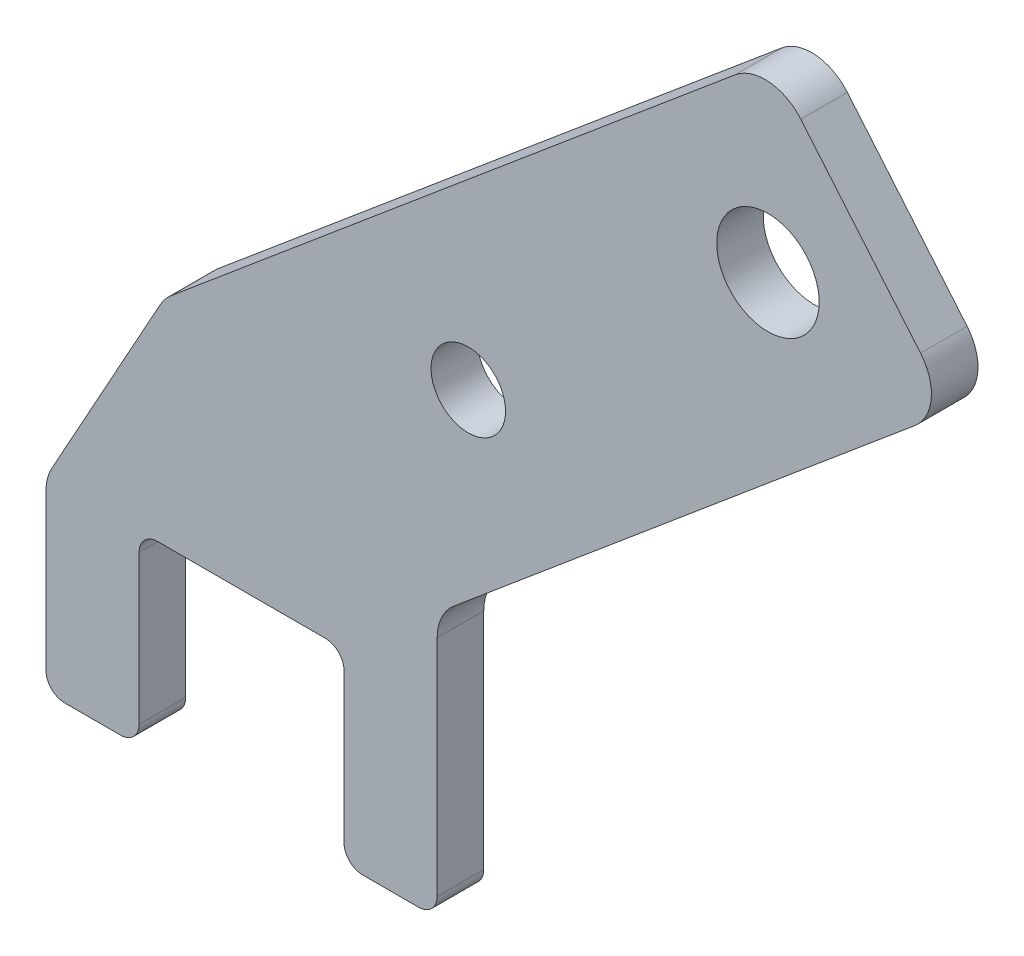
ISO-10303-21;
HEADER;
FILE_DESCRIPTION(('STEP AP214'),'2;1');
FILE_NAME('part.step','',(''),(''),'','','');
FILE_SCHEMA(('AUTOMOTIVE_DESIGN { 1 0 10303 214 1 1 1 1 }'));
ENDSEC;
DATA;
#1=APPLICATION_CONTEXT('core data for automotive mechanical design processes');
#2=APPLICATION_PROTOCOL_DEFINITION('international standard','automotive_design',2000,#1);
#3=PRODUCT_CONTEXT('',#1,'mechanical');
#4=PRODUCT('Part','Part','',(#3));
#5=PRODUCT_RELATED_PRODUCT_CATEGORY('part','',(#4));
#6=PRODUCT_DEFINITION_FORMATION('','',#4);
#7=PRODUCT_DEFINITION_CONTEXT('part definition',#1,'design');
#8=PRODUCT_DEFINITION('design','',#6,#7);
#9=PRODUCT_DEFINITION_SHAPE('','',#8);
#10=(LENGTH_UNIT() NAMED_UNIT(*) SI_UNIT(.MILLI.,.METRE.));
#11=(NAMED_UNIT(*) PLANE_ANGLE_UNIT() SI_UNIT($,.RADIAN.));
#12=(NAMED_UNIT(*) SI_UNIT($,.STERADIAN.) SOLID_ANGLE_UNIT());
#13=UNCERTAINTY_MEASURE_WITH_UNIT(LENGTH_MEASURE(1.E-05),#10,'distance_accuracy_value','');
#14=(GEOMETRIC_REPRESENTATION_CONTEXT(3) GLOBAL_UNCERTAINTY_ASSIGNED_CONTEXT((#13)) GLOBAL_UNIT_ASSIGNED_CONTEXT((#10,
#11,#12)) REPRESENTATION_CONTEXT('',''));
#15=CARTESIAN_POINT('',(0.,0.,0.));
#16=DIRECTION('',(0.,0.,1.));
#17=DIRECTION('',(1.,0.,0.));
#18=AXIS2_PLACEMENT_3D('',#15,#16,#17);
#19=CARTESIAN_POINT('',(0.,0.,5.));
#20=DIRECTION('',(0.,0.,-1.));
#21=DIRECTION('',(-1.,0.,0.));
#22=AXIS2_PLACEMENT_3D('',#19,#20,#21);
#23=PLANE('',#22);
#24=DIRECTION('',(1.,0.,0.));
#25=VECTOR('',#24,1.);
#26=CARTESIAN_POINT('',(24.3977992888339,-20.,5.));
#27=LINE('',#26,#25);
#28=CARTESIAN_POINT('',(26.3977992888339,-20.,5.));
#29=VERTEX_POINT('',#28);
#30=CARTESIAN_POINT('',(32.3977992888339,-20.,5.));
#31=VERTEX_POINT('',#30);
#32=EDGE_CURVE('E341',#29,#31,#27,.T.);
#33=ORIENTED_EDGE('',*,*,#32,.T.);
#34=CARTESIAN_POINT('',(32.3977992888339,-18.,5.));
#35=DIRECTION('',(0.,0.,-1.));
#36=DIRECTION('',(-1.,0.,0.));
#37=AXIS2_PLACEMENT_3D('',#34,#35,#36);
#38=CIRCLE('',#37,2.);
#39=CARTESIAN_POINT('',(34.3977992888339,-18.,5.));
#40=VERTEX_POINT('',#39);
#41=EDGE_CURVE('E294',#31,#40,#38,.F.);
#42=ORIENTED_EDGE('',*,*,#41,.T.);
#43=DIRECTION('',(0.,1.,0.));
#44=VECTOR('',#43,1.);
#45=CARTESIAN_POINT('',(34.3977992888339,-20.,5.));
#46=LINE('',#45,#44);
#47=CARTESIAN_POINT('',(34.3977992888339,6.05945802099784,5.));
#48=VERTEX_POINT('',#47);
#49=EDGE_CURVE('E348',#40,#48,#46,.T.);
#50=ORIENTED_EDGE('',*,*,#49,.T.);
#51=CARTESIAN_POINT('',(39.3977992888339,6.05945802099785,5.));
#52=DIRECTION('',(0.,0.,-1.));
#53=DIRECTION('',(-1.,0.,0.));
#54=AXIS2_PLACEMENT_3D('',#51,#52,#53);
#55=CIRCLE('',#54,5.);
#56=CARTESIAN_POINT('',(36.1838612404012,9.88968023659273,5.));
#57=VERTEX_POINT('',#56);
#58=EDGE_CURVE('E194',#48,#57,#55,.T.);
#59=ORIENTED_EDGE('',*,*,#58,.T.);
#60=DIRECTION('',(0.766044443118977,0.642787609686541,0.));
#61=VECTOR('',#60,1.);
#62=CARTESIAN_POINT('',(34.3977992888339,8.39099631177283,5.));
#63=LINE('',#62,#61);
#64=CARTESIAN_POINT('',(85.6813547383521,51.4230087749233,5.));
#65=VERTEX_POINT('',#64);
#66=EDGE_CURVE('E204',#57,#65,#63,.T.);
#67=ORIENTED_EDGE('',*,*,#66,.T.);
#68=CARTESIAN_POINT('',(82.4674166899194,55.2532309905182,5.));
#69=DIRECTION('',(0.,0.,-1.));
#70=DIRECTION('',(-1.,0.,0.));
#71=AXIS2_PLACEMENT_3D('',#68,#69,#70);
#72=CIRCLE('',#71,5.);
#73=CARTESIAN_POINT('',(86.2976389055143,58.4671690389509,5.));
#74=VERTEX_POINT('',#73);
#75=EDGE_CURVE('E256',#65,#74,#72,.F.);
#76=ORIENTED_EDGE('',*,*,#75,.T.);
#77=DIRECTION('',(-0.642787609686541,0.766044443118976,0.));
#78=VECTOR('',#77,1.);
#79=CARTESIAN_POINT('',(89.511576953947,54.636946823356,5.));
#80=LINE('',#79,#78);
#81=CARTESIAN_POINT('',(73.4418867117835,73.7880579013304,5.));
#82=VERTEX_POINT('',#81);
#83=EDGE_CURVE('E351',#74,#82,#80,.T.);
#84=ORIENTED_EDGE('',*,*,#83,.T.);
#85=CARTESIAN_POINT('',(69.6116644961886,70.5741198528977,5.));
#86=DIRECTION('',(0.,0.,-1.));
#87=DIRECTION('',(-1.,0.,0.));
#88=AXIS2_PLACEMENT_3D('',#85,#86,#87);
#89=CIRCLE('',#88,5.);
#90=CARTESIAN_POINT('',(66.3977264477558,74.4043420684926,5.));
#91=VERTEX_POINT('',#90);
#92=EDGE_CURVE('E254',#82,#91,#89,.F.);
#93=ORIENTED_EDGE('',*,*,#92,.T.);
#94=DIRECTION('',(-0.766044443118977,-0.642787609686541,0.));
#95=VECTOR('',#94,1.);
#96=CARTESIAN_POINT('',(70.2279486633507,77.6182801169253,5.));
#97=LINE('',#96,#95);
#98=CARTESIAN_POINT('',(5.82553770991127,23.5782408389664,5.));
#99=VERTEX_POINT('',#98);
#100=EDGE_CURVE('E354',#91,#99,#97,.T.);
#101=ORIENTED_EDGE('',*,*,#100,.T.);
#102=CARTESIAN_POINT('',(9.03947575834397,19.7480186233715,5.));
#103=DIRECTION('',(0.,0.,-1.));
#104=DIRECTION('',(-1.,0.,0.));
#105=AXIS2_PLACEMENT_3D('',#102,#103,#104);
#106=CIRCLE('',#105,5.);
#107=CARTESIAN_POINT('',(4.6645711585267,22.1688056322795,5.));
#108=VERTEX_POINT('',#107);
#109=EDGE_CURVE('E258',#99,#108,#106,.F.);
#110=ORIENTED_EDGE('',*,*,#109,.T.);
#111=DIRECTION('',(-0.484157401781596,-0.874980919963455,0.));
#112=VECTOR('',#111,1.);
#113=CARTESIAN_POINT('',(-7.60220071116611,0.,5.));
#114=LINE('',#113,#112);
#115=CARTESIAN_POINT('',(-6.97710531098338,1.12968746590294,5.));
#116=VERTEX_POINT('',#115);
#117=EDGE_CURVE('E357',#108,#116,#114,.T.);
#118=ORIENTED_EDGE('',*,*,#117,.T.);
#119=CARTESIAN_POINT('',(-2.60220071116611,-1.29109954300504,5.));
#120=DIRECTION('',(0.,0.,-1.));
#121=DIRECTION('',(-1.,0.,0.));
#122=AXIS2_PLACEMENT_3D('',#119,#120,#121);
#123=CIRCLE('',#122,5.);
#124=CARTESIAN_POINT('',(-7.60220071116611,-1.29109954300504,5.));
#125=VERTEX_POINT('',#124);
#126=EDGE_CURVE('E260',#116,#125,#123,.F.);
#127=ORIENTED_EDGE('',*,*,#126,.T.);
#128=DIRECTION('',(0.,-1.,0.));
#129=VECTOR('',#128,1.);
#130=CARTESIAN_POINT('',(-7.60220071116611,-20.,5.));
#131=LINE('',#130,#129);
#132=CARTESIAN_POINT('',(-7.60220071116611,-18.,5.));
#133=VERTEX_POINT('',#132);
#134=EDGE_CURVE('E360',#125,#133,#131,.T.);
#135=ORIENTED_EDGE('',*,*,#134,.T.);
#136=CARTESIAN_POINT('',(-5.60220071116611,-18.,5.));
#137=DIRECTION('',(0.,0.,-1.));
#138=DIRECTION('',(-1.,0.,0.));
#139=AXIS2_PLACEMENT_3D('',#136,#137,#138);
#140=CIRCLE('',#139,2.);
#141=CARTESIAN_POINT('',(-5.60220071116611,-20.,5.));
#142=VERTEX_POINT('',#141);
#143=EDGE_CURVE('E288',#133,#142,#140,.F.);
#144=ORIENTED_EDGE('',*,*,#143,.T.);
#145=DIRECTION('',(1.,0.,0.));
#146=VECTOR('',#145,1.);
#147=CARTESIAN_POINT('',(2.3977992888339,-20.,5.));
#148=LINE('',#147,#146);
#149=CARTESIAN_POINT('',(0.397799288833899,-20.,5.));
#150=VERTEX_POINT('',#149);
#151=EDGE_CURVE('E363',#142,#150,#148,.T.);
#152=ORIENTED_EDGE('',*,*,#151,.T.);
#153=CARTESIAN_POINT('',(0.397799288833899,-18.,5.));
#154=DIRECTION('',(0.,0.,-1.));
#155=DIRECTION('',(-1.,0.,0.));
#156=AXIS2_PLACEMENT_3D('',#153,#154,#155);
#157=CIRCLE('',#156,2.);
#158=CARTESIAN_POINT('',(2.3977992888339,-18.,5.));
#159=VERTEX_POINT('',#158);
#160=EDGE_CURVE('E290',#150,#159,#157,.F.);
#161=ORIENTED_EDGE('',*,*,#160,.T.);
#162=DIRECTION('',(0.,1.,0.));
#163=VECTOR('',#162,1.);
#164=CARTESIAN_POINT('',(2.39779928883393,0.,5.));
#165=LINE('',#164,#163);
#166=CARTESIAN_POINT('',(2.39779928883393,-2.,5.));
#167=VERTEX_POINT('',#166);
#168=EDGE_CURVE('E236',#159,#167,#165,.T.);
#169=ORIENTED_EDGE('',*,*,#168,.T.);
#170=CARTESIAN_POINT('',(4.39779928883393,-2.,5.));
#171=DIRECTION('',(0.,0.,-1.));
#172=DIRECTION('',(-1.,0.,0.));
#173=AXIS2_PLACEMENT_3D('',#170,#171,#172);
#174=CIRCLE('',#173,2.);
#175=CARTESIAN_POINT('',(4.39779928883393,0.,5.));
#176=VERTEX_POINT('',#175);
#177=EDGE_CURVE('E11',#167,#176,#174,.T.);
#178=ORIENTED_EDGE('',*,*,#177,.T.);
#179=DIRECTION('',(1.,0.,0.));
#180=VECTOR('',#179,1.);
#181=CARTESIAN_POINT('',(2.39779928883393,0.,5.));
#182=LINE('',#181,#180);
#183=CARTESIAN_POINT('',(22.3977992888339,0.,5.));
#184=VERTEX_POINT('',#183);
#185=EDGE_CURVE('E235',#176,#184,#182,.T.);
#186=ORIENTED_EDGE('',*,*,#185,.T.);
#187=CARTESIAN_POINT('',(22.3977992888339,-2.,5.));
#188=DIRECTION('',(0.,0.,-1.));
#189=DIRECTION('',(-1.,0.,0.));
#190=AXIS2_PLACEMENT_3D('',#187,#188,#189);
#191=CIRCLE('',#190,2.);
#192=CARTESIAN_POINT('',(24.3977992888339,-2.,5.));
#193=VERTEX_POINT('',#192);
#194=EDGE_CURVE('E55',#184,#193,#191,.T.);
#195=ORIENTED_EDGE('',*,*,#194,.T.);
#196=DIRECTION('',(0.,-1.,0.));
#197=VECTOR('',#196,1.);
#198=CARTESIAN_POINT('',(24.3977992888339,0.,5.));
#199=LINE('',#198,#197);
#200=CARTESIAN_POINT('',(24.3977992888339,-18.,5.));
#201=VERTEX_POINT('',#200);
#202=EDGE_CURVE('E339',#193,#201,#199,.T.);
#203=ORIENTED_EDGE('',*,*,#202,.T.);
#204=CARTESIAN_POINT('',(26.3977992888339,-18.,5.));
#205=DIRECTION('',(0.,0.,-1.));
#206=DIRECTION('',(-1.,0.,0.));
#207=AXIS2_PLACEMENT_3D('',#204,#205,#206);
#208=CIRCLE('',#207,2.);
#209=EDGE_CURVE('E292',#201,#29,#208,.F.);
#210=ORIENTED_EDGE('',*,*,#209,.T.);
#211=EDGE_LOOP('',(#33,#42,#50,#59,#67,#76,#84,#93,#101,#110,#118,#127,#135,#144,#152,#161,#169,
#178,#186,#195,#203,#210));
#212=FACE_BOUND('',#211,.T.);
#213=CARTESIAN_POINT('',(69.9111850481021,57.7713745442156,5.));
#214=DIRECTION('',(0.,0.,1.));
#215=DIRECTION('',(1.,0.,0.));
#216=AXIS2_PLACEMENT_3D('',#213,#214,#215);
#217=CIRCLE('',#216,5.49999999999994);
#218=CARTESIAN_POINT('',(75.411185048102,57.7713745442156,5.));
#219=VERTEX_POINT('',#218);
#220=EDGE_CURVE('E369',#219,#219,#217,.T.);
#221=ORIENTED_EDGE('',*,*,#220,.F.);
#222=EDGE_LOOP('',(#221));
#223=FACE_BOUND('',#222,.T.);
#224=CARTESIAN_POINT('',(37.7373184371051,30.7742949373809,5.));
#225=DIRECTION('',(0.,0.,1.));
#226=DIRECTION('',(1.,0.,0.));
#227=AXIS2_PLACEMENT_3D('',#224,#225,#226);
#228=CIRCLE('',#227,4.);
#229=CARTESIAN_POINT('',(41.7373184371051,30.7742949373809,5.));
#230=VERTEX_POINT('',#229);
#231=EDGE_CURVE('E654',#230,#230,#228,.T.);
#232=ORIENTED_EDGE('',*,*,#231,.F.);
#233=EDGE_LOOP('',(#232));
#234=FACE_BOUND('',#233,.T.);
#235=ADVANCED_FACE('F33',(#212,#223,#234),#23,.F.);
#236=CARTESIAN_POINT('',(0.,0.,0.));
#237=DIRECTION('',(0.,0.,-1.));
#238=DIRECTION('',(-1.,0.,0.));
#239=AXIS2_PLACEMENT_3D('',#236,#237,#238);
#240=PLANE('',#239);
#241=CARTESIAN_POINT('',(69.9111850481021,57.7713745442156,0.));
#242=DIRECTION('',(0.,0.,1.));
#243=DIRECTION('',(1.,0.,0.));
#244=AXIS2_PLACEMENT_3D('',#241,#242,#243);
#245=CIRCLE('',#244,5.49999999999994);
#246=CARTESIAN_POINT('',(75.411185048102,57.7713745442156,0.));
#247=VERTEX_POINT('',#246);
#248=EDGE_CURVE('E344',#247,#247,#245,.T.);
#249=ORIENTED_EDGE('',*,*,#248,.T.);
#250=EDGE_LOOP('',(#249));
#251=FACE_BOUND('',#250,.T.);
#252=DIRECTION('',(0.,1.,0.));
#253=VECTOR('',#252,1.);
#254=CARTESIAN_POINT('',(34.3977992888339,-20.,0.));
#255=LINE('',#254,#253);
#256=CARTESIAN_POINT('',(34.3977992888339,-18.,0.));
#257=VERTEX_POINT('',#256);
#258=CARTESIAN_POINT('',(34.3977992888339,6.05945802099784,0.));
#259=VERTEX_POINT('',#258);
#260=EDGE_CURVE('E212',#257,#259,#255,.T.);
#261=ORIENTED_EDGE('',*,*,#260,.F.);
#262=CARTESIAN_POINT('',(32.3977992888339,-18.,0.));
#263=DIRECTION('',(0.,0.,-1.));
#264=DIRECTION('',(-1.,0.,0.));
#265=AXIS2_PLACEMENT_3D('',#262,#263,#264);
#266=CIRCLE('',#265,2.);
#267=CARTESIAN_POINT('',(32.3977992888339,-20.,0.));
#268=VERTEX_POINT('',#267);
#269=EDGE_CURVE('E281',#257,#268,#266,.T.);
#270=ORIENTED_EDGE('',*,*,#269,.T.);
#271=DIRECTION('',(1.,0.,0.));
#272=VECTOR('',#271,1.);
#273=CARTESIAN_POINT('',(24.3977992888339,-20.,0.));
#274=LINE('',#273,#272);
#275=CARTESIAN_POINT('',(26.3977992888339,-20.,0.));
#276=VERTEX_POINT('',#275);
#277=EDGE_CURVE('E217',#276,#268,#274,.T.);
#278=ORIENTED_EDGE('',*,*,#277,.F.);
#279=CARTESIAN_POINT('',(26.3977992888339,-18.,0.));
#280=DIRECTION('',(0.,0.,-1.));
#281=DIRECTION('',(-1.,0.,0.));
#282=AXIS2_PLACEMENT_3D('',#279,#280,#281);
#283=CIRCLE('',#282,2.);
#284=CARTESIAN_POINT('',(24.3977992888339,-18.,0.));
#285=VERTEX_POINT('',#284);
#286=EDGE_CURVE('E279',#276,#285,#283,.T.);
#287=ORIENTED_EDGE('',*,*,#286,.T.);
#288=DIRECTION('',(0.,-1.,0.));
#289=VECTOR('',#288,1.);
#290=CARTESIAN_POINT('',(24.3977992888339,0.,0.));
#291=LINE('',#290,#289);
#292=CARTESIAN_POINT('',(24.3977992888339,-2.,0.));
#293=VERTEX_POINT('',#292);
#294=EDGE_CURVE('E368',#293,#285,#291,.T.);
#295=ORIENTED_EDGE('',*,*,#294,.F.);
#296=CARTESIAN_POINT('',(22.3977992888339,-2.,0.));
#297=DIRECTION('',(0.,0.,-1.));
#298=DIRECTION('',(-1.,0.,0.));
#299=AXIS2_PLACEMENT_3D('',#296,#297,#298);
#300=CIRCLE('',#299,2.);
#301=CARTESIAN_POINT('',(22.3977992888339,0.,0.));
#302=VERTEX_POINT('',#301);
#303=EDGE_CURVE('E317',#293,#302,#300,.F.);
#304=ORIENTED_EDGE('',*,*,#303,.T.);
#305=DIRECTION('',(1.,0.,0.));
#306=VECTOR('',#305,1.);
#307=CARTESIAN_POINT('',(2.39779928883393,0.,0.));
#308=LINE('',#307,#306);
#309=CARTESIAN_POINT('',(4.39779928883393,0.,0.));
#310=VERTEX_POINT('',#309);
#311=EDGE_CURVE('E322',#310,#302,#308,.T.);
#312=ORIENTED_EDGE('',*,*,#311,.F.);
#313=CARTESIAN_POINT('',(4.39779928883393,-2.,0.));
#314=DIRECTION('',(0.,0.,-1.));
#315=DIRECTION('',(-1.,0.,0.));
#316=AXIS2_PLACEMENT_3D('',#313,#314,#315);
#317=CIRCLE('',#316,2.);
#318=CARTESIAN_POINT('',(2.39779928883393,-2.,0.));
#319=VERTEX_POINT('',#318);
#320=EDGE_CURVE('E41',#310,#319,#317,.F.);
#321=ORIENTED_EDGE('',*,*,#320,.T.);
#322=DIRECTION('',(0.,1.,0.));
#323=VECTOR('',#322,1.);
#324=CARTESIAN_POINT('',(2.39779928883393,0.,0.));
#325=LINE('',#324,#323);
#326=CARTESIAN_POINT('',(2.3977992888339,-18.,0.));
#327=VERTEX_POINT('',#326);
#328=EDGE_CURVE('E232',#327,#319,#325,.T.);
#329=ORIENTED_EDGE('',*,*,#328,.F.);
#330=CARTESIAN_POINT('',(0.397799288833899,-18.,0.));
#331=DIRECTION('',(0.,0.,-1.));
#332=DIRECTION('',(-1.,0.,0.));
#333=AXIS2_PLACEMENT_3D('',#330,#331,#332);
#334=CIRCLE('',#333,2.);
#335=CARTESIAN_POINT('',(0.397799288833899,-20.,0.));
#336=VERTEX_POINT('',#335);
#337=EDGE_CURVE('E277',#327,#336,#334,.T.);
#338=ORIENTED_EDGE('',*,*,#337,.T.);
#339=DIRECTION('',(1.,0.,0.));
#340=VECTOR('',#339,1.);
#341=CARTESIAN_POINT('',(2.3977992888339,-20.,0.));
#342=LINE('',#341,#340);
#343=CARTESIAN_POINT('',(-5.60220071116611,-20.,0.));
#344=VERTEX_POINT('',#343);
#345=EDGE_CURVE('E229',#344,#336,#342,.T.);
#346=ORIENTED_EDGE('',*,*,#345,.F.);
#347=CARTESIAN_POINT('',(-5.60220071116611,-18.,0.));
#348=DIRECTION('',(0.,0.,-1.));
#349=DIRECTION('',(-1.,0.,0.));
#350=AXIS2_PLACEMENT_3D('',#347,#348,#349);
#351=CIRCLE('',#350,2.);
#352=CARTESIAN_POINT('',(-7.60220071116611,-18.,0.));
#353=VERTEX_POINT('',#352);
#354=EDGE_CURVE('E275',#344,#353,#351,.T.);
#355=ORIENTED_EDGE('',*,*,#354,.T.);
#356=DIRECTION('',(0.,-1.,0.));
#357=VECTOR('',#356,1.);
#358=CARTESIAN_POINT('',(-7.60220071116611,-20.,0.));
#359=LINE('',#358,#357);
#360=CARTESIAN_POINT('',(-7.60220071116611,-1.29109954300504,0.));
#361=VERTEX_POINT('',#360);
#362=EDGE_CURVE('E226',#361,#353,#359,.T.);
#363=ORIENTED_EDGE('',*,*,#362,.F.);
#364=CARTESIAN_POINT('',(-2.60220071116611,-1.29109954300504,0.));
#365=DIRECTION('',(0.,0.,-1.));
#366=DIRECTION('',(-1.,0.,0.));
#367=AXIS2_PLACEMENT_3D('',#364,#365,#366);
#368=CIRCLE('',#367,5.);
#369=CARTESIAN_POINT('',(-6.97710531098338,1.12968746590294,0.));
#370=VERTEX_POINT('',#369);
#371=EDGE_CURVE('E247',#361,#370,#368,.T.);
#372=ORIENTED_EDGE('',*,*,#371,.T.);
#373=DIRECTION('',(-0.484157401781596,-0.874980919963455,0.));
#374=VECTOR('',#373,1.);
#375=CARTESIAN_POINT('',(-7.60220071116611,0.,0.));
#376=LINE('',#375,#374);
#377=CARTESIAN_POINT('',(4.6645711585267,22.1688056322795,0.));
#378=VERTEX_POINT('',#377);
#379=EDGE_CURVE('E223',#378,#370,#376,.T.);
#380=ORIENTED_EDGE('',*,*,#379,.F.);
#381=CARTESIAN_POINT('',(9.03947575834397,19.7480186233715,0.));
#382=DIRECTION('',(0.,0.,-1.));
#383=DIRECTION('',(-1.,0.,0.));
#384=AXIS2_PLACEMENT_3D('',#381,#382,#383);
#385=CIRCLE('',#384,5.);
#386=CARTESIAN_POINT('',(5.82553770991127,23.5782408389664,0.));
#387=VERTEX_POINT('',#386);
#388=EDGE_CURVE('E245',#378,#387,#385,.T.);
#389=ORIENTED_EDGE('',*,*,#388,.T.);
#390=DIRECTION('',(-0.766044443118977,-0.642787609686541,0.));
#391=VECTOR('',#390,1.);
#392=CARTESIAN_POINT('',(70.2279486633507,77.6182801169253,0.));
#393=LINE('',#392,#391);
#394=CARTESIAN_POINT('',(66.3977264477558,74.4043420684926,0.));
#395=VERTEX_POINT('',#394);
#396=EDGE_CURVE('E215',#395,#387,#393,.T.);
#397=ORIENTED_EDGE('',*,*,#396,.F.);
#398=CARTESIAN_POINT('',(69.6116644961886,70.5741198528977,0.));
#399=DIRECTION('',(0.,0.,-1.));
#400=DIRECTION('',(-1.,0.,0.));
#401=AXIS2_PLACEMENT_3D('',#398,#399,#400);
#402=CIRCLE('',#401,5.);
#403=CARTESIAN_POINT('',(73.4418867117835,73.7880579013304,0.));
#404=VERTEX_POINT('',#403);
#405=EDGE_CURVE('E242',#395,#404,#402,.T.);
#406=ORIENTED_EDGE('',*,*,#405,.T.);
#407=DIRECTION('',(-0.642787609686541,0.766044443118976,0.));
#408=VECTOR('',#407,1.);
#409=CARTESIAN_POINT('',(89.511576953947,54.636946823356,0.));
#410=LINE('',#409,#408);
#411=CARTESIAN_POINT('',(86.2976389055143,58.4671690389509,0.));
#412=VERTEX_POINT('',#411);
#413=EDGE_CURVE('E211',#412,#404,#410,.T.);
#414=ORIENTED_EDGE('',*,*,#413,.F.);
#415=CARTESIAN_POINT('',(82.4674166899194,55.2532309905182,0.));
#416=DIRECTION('',(0.,0.,-1.));
#417=DIRECTION('',(-1.,0.,0.));
#418=AXIS2_PLACEMENT_3D('',#415,#416,#417);
#419=CIRCLE('',#418,5.);
#420=CARTESIAN_POINT('',(85.6813547383521,51.4230087749233,0.));
#421=VERTEX_POINT('',#420);
#422=EDGE_CURVE('E210',#412,#421,#419,.T.);
#423=ORIENTED_EDGE('',*,*,#422,.T.);
#424=DIRECTION('',(0.766044443118977,0.642787609686541,0.));
#425=VECTOR('',#424,1.);
#426=CARTESIAN_POINT('',(34.3977992888339,8.39099631177283,0.));
#427=LINE('',#426,#425);
#428=CARTESIAN_POINT('',(36.1838612404012,9.88968023659273,0.));
#429=VERTEX_POINT('',#428);
#430=EDGE_CURVE('E201',#429,#421,#427,.T.);
#431=ORIENTED_EDGE('',*,*,#430,.F.);
#432=CARTESIAN_POINT('',(39.3977992888339,6.05945802099785,0.));
#433=DIRECTION('',(0.,0.,-1.));
#434=DIRECTION('',(-1.,0.,0.));
#435=AXIS2_PLACEMENT_3D('',#432,#433,#434);
#436=CIRCLE('',#435,5.);
#437=EDGE_CURVE('E184',#429,#259,#436,.F.);
#438=ORIENTED_EDGE('',*,*,#437,.T.);
#439=EDGE_LOOP('',(#261,#270,#278,#287,#295,#304,#312,#321,#329,#338,#346,#355,#363,#372,#380,
#389,#397,#406,#414,#423,#431,#438));
#440=FACE_BOUND('',#439,.T.);
#441=CARTESIAN_POINT('',(37.7373184371051,30.7742949373809,0.));
#442=DIRECTION('',(0.,0.,1.));
#443=DIRECTION('',(1.,0.,0.));
#444=AXIS2_PLACEMENT_3D('',#441,#442,#443);
#445=CIRCLE('',#444,4.);
#446=CARTESIAN_POINT('',(41.7373184371051,30.7742949373809,0.));
#447=VERTEX_POINT('',#446);
#448=EDGE_CURVE('E656',#447,#447,#445,.T.);
#449=ORIENTED_EDGE('',*,*,#448,.T.);
#450=EDGE_LOOP('',(#449));
#451=FACE_BOUND('',#450,.T.);
#452=ADVANCED_FACE('F207',(#251,#440,#451),#240,.T.);
#453=CARTESIAN_POINT('',(2.39779928883393,0.,5.));
#454=DIRECTION('',(0.,1.,0.));
#455=DIRECTION('',(-1.,0.,0.));
#456=AXIS2_PLACEMENT_3D('',#453,#454,#455);
#457=PLANE('',#456);
#458=ORIENTED_EDGE('',*,*,#311,.T.);
#459=DIRECTION('',(0.,0.,-1.));
#460=VECTOR('',#459,1.);
#461=CARTESIAN_POINT('',(22.3977992888339,0.,5.));
#462=LINE('',#461,#460);
#463=EDGE_CURVE('E303',#302,#184,#462,.F.);
#464=ORIENTED_EDGE('',*,*,#463,.T.);
#465=ORIENTED_EDGE('',*,*,#185,.F.);
#466=DIRECTION('',(0.,0.,-1.));
#467=VECTOR('',#466,1.);
#468=CARTESIAN_POINT('',(4.39779928883393,0.,0.));
#469=LINE('',#468,#467);
#470=EDGE_CURVE('E300',#176,#310,#469,.T.);
#471=ORIENTED_EDGE('',*,*,#470,.T.);
#472=EDGE_LOOP('',(#458,#464,#465,#471));
#473=FACE_BOUND('',#472,.T.);
#474=ADVANCED_FACE('F337',(#473),#457,.F.);
#475=CARTESIAN_POINT('',(24.3977992888339,0.,5.));
#476=DIRECTION('',(1.,0.,0.));
#477=DIRECTION('',(0.,0.,-1.));
#478=AXIS2_PLACEMENT_3D('',#475,#476,#477);
#479=PLANE('',#478);
#480=ORIENTED_EDGE('',*,*,#294,.T.);
#481=DIRECTION('',(0.,0.,-1.));
#482=VECTOR('',#481,1.);
#483=CARTESIAN_POINT('',(24.3977992888339,-18.,5.));
#484=LINE('',#483,#482);
#485=EDGE_CURVE('E48',#285,#201,#484,.F.);
#486=ORIENTED_EDGE('',*,*,#485,.T.);
#487=ORIENTED_EDGE('',*,*,#202,.F.);
#488=DIRECTION('',(0.,0.,-1.));
#489=VECTOR('',#488,1.);
#490=CARTESIAN_POINT('',(24.3977992888339,-2.,0.));
#491=LINE('',#490,#489);
#492=EDGE_CURVE('E296',#193,#293,#491,.T.);
#493=ORIENTED_EDGE('',*,*,#492,.T.);
#494=EDGE_LOOP('',(#480,#486,#487,#493));
#495=FACE_BOUND('',#494,.T.);
#496=ADVANCED_FACE('F466',(#495),#479,.F.);
#497=CARTESIAN_POINT('',(24.3977992888339,-20.,5.));
#498=DIRECTION('',(0.,1.,0.));
#499=DIRECTION('',(-1.,0.,0.));
#500=AXIS2_PLACEMENT_3D('',#497,#498,#499);
#501=PLANE('',#500);
#502=ORIENTED_EDGE('',*,*,#277,.T.);
#503=DIRECTION('',(0.,0.,-1.));
#504=VECTOR('',#503,1.);
#505=CARTESIAN_POINT('',(32.3977992888339,-20.,5.));
#506=LINE('',#505,#504);
#507=EDGE_CURVE('E286',#268,#31,#506,.F.);
#508=ORIENTED_EDGE('',*,*,#507,.T.);
#509=ORIENTED_EDGE('',*,*,#32,.F.);
#510=DIRECTION('',(0.,0.,-1.));
#511=VECTOR('',#510,1.);
#512=CARTESIAN_POINT('',(26.3977992888339,-20.,5.));
#513=LINE('',#512,#511);
#514=EDGE_CURVE('E283',#29,#276,#513,.T.);
#515=ORIENTED_EDGE('',*,*,#514,.T.);
#516=EDGE_LOOP('',(#502,#508,#509,#515));
#517=FACE_BOUND('',#516,.T.);
#518=ADVANCED_FACE('F374',(#517),#501,.F.);
#519=CARTESIAN_POINT('',(34.3977992888339,-20.,5.));
#520=DIRECTION('',(-1.,0.,0.));
#521=DIRECTION('',(0.,0.,1.));
#522=AXIS2_PLACEMENT_3D('',#519,#520,#521);
#523=PLANE('',#522);
#524=ORIENTED_EDGE('',*,*,#49,.F.);
#525=DIRECTION('',(0.,0.,-1.));
#526=VECTOR('',#525,1.);
#527=CARTESIAN_POINT('',(34.3977992888339,-18.,5.));
#528=LINE('',#527,#526);
#529=EDGE_CURVE('E272',#40,#257,#528,.T.);
#530=ORIENTED_EDGE('',*,*,#529,.T.);
#531=ORIENTED_EDGE('',*,*,#260,.T.);
#532=DIRECTION('',(0.,0.,-1.));
#533=VECTOR('',#532,1.);
#534=CARTESIAN_POINT('',(34.3977992888339,6.05945802099785,5.));
#535=LINE('',#534,#533);
#536=EDGE_CURVE('E190',#259,#48,#535,.F.);
#537=ORIENTED_EDGE('',*,*,#536,.T.);
#538=EDGE_LOOP('',(#524,#530,#531,#537));
#539=FACE_BOUND('',#538,.T.);
#540=ADVANCED_FACE('F383',(#539),#523,.F.);
#541=CARTESIAN_POINT('',(34.3977992888339,8.39099631177283,5.));
#542=DIRECTION('',(-0.642787609686541,0.766044443118977,0.));
#543=DIRECTION('',(-0.766044443118977,-0.642787609686541,0.));
#544=AXIS2_PLACEMENT_3D('',#541,#542,#543);
#545=PLANE('',#544);
#546=ORIENTED_EDGE('',*,*,#66,.F.);
#547=DIRECTION('',(0.,0.,-1.));
#548=VECTOR('',#547,1.);
#549=CARTESIAN_POINT('',(36.1838612404012,9.88968023659273,0.));
#550=LINE('',#549,#548);
#551=EDGE_CURVE('E188',#57,#429,#550,.T.);
#552=ORIENTED_EDGE('',*,*,#551,.T.);
#553=ORIENTED_EDGE('',*,*,#430,.T.);
#554=DIRECTION('',(0.,0.,-1.));
#555=VECTOR('',#554,1.);
#556=CARTESIAN_POINT('',(85.6813547383521,51.4230087749233,5.));
#557=LINE('',#556,#555);
#558=EDGE_CURVE('E205',#421,#65,#557,.F.);
#559=ORIENTED_EDGE('',*,*,#558,.T.);
#560=EDGE_LOOP('',(#546,#552,#553,#559));
#561=FACE_BOUND('',#560,.T.);
#562=ADVANCED_FACE('F200',(#561),#545,.F.);
#563=CARTESIAN_POINT('',(89.511576953947,54.636946823356,5.));
#564=DIRECTION('',(-0.766044443118976,-0.642787609686541,0.));
#565=DIRECTION('',(0.642787609686541,-0.766044443118977,0.));
#566=AXIS2_PLACEMENT_3D('',#563,#564,#565);
#567=PLANE('',#566);
#568=ORIENTED_EDGE('',*,*,#83,.F.);
#569=DIRECTION('',(0.,0.,-1.));
#570=VECTOR('',#569,1.);
#571=CARTESIAN_POINT('',(86.2976389055143,58.4671690389509,5.));
#572=LINE('',#571,#570);
#573=EDGE_CURVE('E195',#74,#412,#572,.T.);
#574=ORIENTED_EDGE('',*,*,#573,.T.);
#575=ORIENTED_EDGE('',*,*,#413,.T.);
#576=DIRECTION('',(0.,0.,-1.));
#577=VECTOR('',#576,1.);
#578=CARTESIAN_POINT('',(73.4418867117834,73.7880579013304,5.));
#579=LINE('',#578,#577);
#580=EDGE_CURVE('E267',#404,#82,#579,.F.);
#581=ORIENTED_EDGE('',*,*,#580,.T.);
#582=EDGE_LOOP('',(#568,#574,#575,#581));
#583=FACE_BOUND('',#582,.T.);
#584=ADVANCED_FACE('F390',(#583),#567,.F.);
#585=CARTESIAN_POINT('',(70.2279486633507,77.6182801169253,5.));
#586=DIRECTION('',(0.642787609686541,-0.766044443118977,0.));
#587=DIRECTION('',(0.766044443118977,0.642787609686541,0.));
#588=AXIS2_PLACEMENT_3D('',#585,#586,#587);
#589=PLANE('',#588);
#590=ORIENTED_EDGE('',*,*,#396,.T.);
#591=DIRECTION('',(0.,0.,-1.));
#592=VECTOR('',#591,1.);
#593=CARTESIAN_POINT('',(5.82553770991126,23.5782408389664,5.));
#594=LINE('',#593,#592);
#595=EDGE_CURVE('E265',#387,#99,#594,.F.);
#596=ORIENTED_EDGE('',*,*,#595,.T.);
#597=ORIENTED_EDGE('',*,*,#100,.F.);
#598=DIRECTION('',(0.,0.,-1.));
#599=VECTOR('',#598,1.);
#600=CARTESIAN_POINT('',(66.3977264477558,74.4043420684926,5.));
#601=LINE('',#600,#599);
#602=EDGE_CURVE('E262',#91,#395,#601,.T.);
#603=ORIENTED_EDGE('',*,*,#602,.T.);
#604=EDGE_LOOP('',(#590,#596,#597,#603));
#605=FACE_BOUND('',#604,.T.);
#606=ADVANCED_FACE('F399',(#605),#589,.F.);
#607=CARTESIAN_POINT('',(-7.60220071116611,0.,5.));
#608=DIRECTION('',(0.874980919963455,-0.484157401781596,0.));
#609=DIRECTION('',(0.484157401781596,0.874980919963455,0.));
#610=AXIS2_PLACEMENT_3D('',#607,#608,#609);
#611=PLANE('',#610);
#612=ORIENTED_EDGE('',*,*,#379,.T.);
#613=DIRECTION('',(0.,0.,-1.));
#614=VECTOR('',#613,1.);
#615=CARTESIAN_POINT('',(-6.97710531098338,1.12968746590294,5.));
#616=LINE('',#615,#614);
#617=EDGE_CURVE('E252',#370,#116,#616,.F.);
#618=ORIENTED_EDGE('',*,*,#617,.T.);
#619=ORIENTED_EDGE('',*,*,#117,.F.);
#620=DIRECTION('',(0.,0.,-1.));
#621=VECTOR('',#620,1.);
#622=CARTESIAN_POINT('',(4.6645711585267,22.1688056322795,5.));
#623=LINE('',#622,#621);
#624=EDGE_CURVE('E249',#108,#378,#623,.T.);
#625=ORIENTED_EDGE('',*,*,#624,.T.);
#626=EDGE_LOOP('',(#612,#618,#619,#625));
#627=FACE_BOUND('',#626,.T.);
#628=ADVANCED_FACE('F408',(#627),#611,.F.);
#629=CARTESIAN_POINT('',(-7.60220071116611,-20.,5.));
#630=DIRECTION('',(1.,0.,0.));
#631=DIRECTION('',(0.,0.,-1.));
#632=AXIS2_PLACEMENT_3D('',#629,#630,#631);
#633=PLANE('',#632);
#634=ORIENTED_EDGE('',*,*,#362,.T.);
#635=DIRECTION('',(0.,0.,-1.));
#636=VECTOR('',#635,1.);
#637=CARTESIAN_POINT('',(-7.60220071116611,-18.,5.));
#638=LINE('',#637,#636);
#639=EDGE_CURVE('E315',#353,#133,#638,.F.);
#640=ORIENTED_EDGE('',*,*,#639,.T.);
#641=ORIENTED_EDGE('',*,*,#134,.F.);
#642=DIRECTION('',(0.,0.,-1.));
#643=VECTOR('',#642,1.);
#644=CARTESIAN_POINT('',(-7.60220071116611,-1.29109954300504,5.));
#645=LINE('',#644,#643);
#646=EDGE_CURVE('E239',#125,#361,#645,.T.);
#647=ORIENTED_EDGE('',*,*,#646,.T.);
#648=EDGE_LOOP('',(#634,#640,#641,#647));
#649=FACE_BOUND('',#648,.T.);
#650=ADVANCED_FACE('F417',(#649),#633,.F.);
#651=CARTESIAN_POINT('',(2.3977992888339,-20.,5.));
#652=DIRECTION('',(0.,1.,0.));
#653=DIRECTION('',(-1.,0.,0.));
#654=AXIS2_PLACEMENT_3D('',#651,#652,#653);
#655=PLANE('',#654);
#656=ORIENTED_EDGE('',*,*,#345,.T.);
#657=DIRECTION('',(0.,0.,-1.));
#658=VECTOR('',#657,1.);
#659=CARTESIAN_POINT('',(0.397799288833899,-20.,5.));
#660=LINE('',#659,#658);
#661=EDGE_CURVE('E313',#336,#150,#660,.F.);
#662=ORIENTED_EDGE('',*,*,#661,.T.);
#663=ORIENTED_EDGE('',*,*,#151,.F.);
#664=DIRECTION('',(0.,0.,-1.));
#665=VECTOR('',#664,1.);
#666=CARTESIAN_POINT('',(-5.60220071116611,-20.,5.));
#667=LINE('',#666,#665);
#668=EDGE_CURVE('E310',#142,#344,#667,.T.);
#669=ORIENTED_EDGE('',*,*,#668,.T.);
#670=EDGE_LOOP('',(#656,#662,#663,#669));
#671=FACE_BOUND('',#670,.T.);
#672=ADVANCED_FACE('F425',(#671),#655,.F.);
#673=CARTESIAN_POINT('',(2.39779928883393,0.,5.));
#674=DIRECTION('',(-1.,0.,0.));
#675=DIRECTION('',(0.,-1.,0.));
#676=AXIS2_PLACEMENT_3D('',#673,#674,#675);
#677=PLANE('',#676);
#678=ORIENTED_EDGE('',*,*,#328,.T.);
#679=DIRECTION('',(0.,0.,-1.));
#680=VECTOR('',#679,1.);
#681=CARTESIAN_POINT('',(2.39779928883393,-2.,5.));
#682=LINE('',#681,#680);
#683=EDGE_CURVE('E308',#319,#167,#682,.F.);
#684=ORIENTED_EDGE('',*,*,#683,.T.);
#685=ORIENTED_EDGE('',*,*,#168,.F.);
#686=DIRECTION('',(0.,0.,-1.));
#687=VECTOR('',#686,1.);
#688=CARTESIAN_POINT('',(2.3977992888339,-18.,5.));
#689=LINE('',#688,#687);
#690=EDGE_CURVE('E305',#159,#327,#689,.T.);
#691=ORIENTED_EDGE('',*,*,#690,.T.);
#692=EDGE_LOOP('',(#678,#684,#685,#691));
#693=FACE_BOUND('',#692,.T.);
#694=ADVANCED_FACE('F327',(#693),#677,.F.);
#695=CARTESIAN_POINT('',(69.9111850481021,57.7713745442156,5.));
#696=DIRECTION('',(0.,0.,-1.));
#697=DIRECTION('',(-1.,0.,0.));
#698=AXIS2_PLACEMENT_3D('',#695,#696,#697);
#699=CYLINDRICAL_SURFACE('',#698,5.49999999999994);
#700=ORIENTED_EDGE('',*,*,#220,.T.);
#701=EDGE_LOOP('',(#700));
#702=FACE_BOUND('',#701,.T.);
#703=ORIENTED_EDGE('',*,*,#248,.F.);
#704=EDGE_LOOP('',(#703));
#705=FACE_BOUND('',#704,.T.);
#706=ADVANCED_FACE('F445',(#702,#705),#699,.F.);
#707=CARTESIAN_POINT('',(37.7373184371051,30.7742949373809,5.));
#708=DIRECTION('',(0.,0.,-1.));
#709=DIRECTION('',(-1.,0.,0.));
#710=AXIS2_PLACEMENT_3D('',#707,#708,#709);
#711=CYLINDRICAL_SURFACE('',#710,4.);
#712=ORIENTED_EDGE('',*,*,#231,.T.);
#713=EDGE_LOOP('',(#712));
#714=FACE_BOUND('',#713,.T.);
#715=ORIENTED_EDGE('',*,*,#448,.F.);
#716=EDGE_LOOP('',(#715));
#717=FACE_BOUND('',#716,.T.);
#718=ADVANCED_FACE('F473',(#714,#717),#711,.F.);
#719=CARTESIAN_POINT('',(39.3977992888339,6.05945802099785,5.));
#720=DIRECTION('',(0.,0.,1.));
#721=DIRECTION('',(1.,0.,0.));
#722=AXIS2_PLACEMENT_3D('',#719,#720,#721);
#723=CYLINDRICAL_SURFACE('',#722,5.);
#724=ORIENTED_EDGE('',*,*,#58,.F.);
#725=ORIENTED_EDGE('',*,*,#536,.F.);
#726=ORIENTED_EDGE('',*,*,#437,.F.);
#727=ORIENTED_EDGE('',*,*,#551,.F.);
#728=EDGE_LOOP('',(#724,#725,#726,#727));
#729=FACE_BOUND('',#728,.T.);
#730=ADVANCED_FACE('F187',(#729),#723,.F.);
#731=CARTESIAN_POINT('',(-2.60220071116611,-1.29109954300504,5.));
#732=DIRECTION('',(0.,0.,-1.));
#733=DIRECTION('',(-1.,0.,0.));
#734=AXIS2_PLACEMENT_3D('',#731,#732,#733);
#735=CYLINDRICAL_SURFACE('',#734,5.);
#736=ORIENTED_EDGE('',*,*,#126,.F.);
#737=ORIENTED_EDGE('',*,*,#617,.F.);
#738=ORIENTED_EDGE('',*,*,#371,.F.);
#739=ORIENTED_EDGE('',*,*,#646,.F.);
#740=EDGE_LOOP('',(#736,#737,#738,#739));
#741=FACE_BOUND('',#740,.T.);
#742=ADVANCED_FACE('F414',(#741),#735,.T.);
#743=CARTESIAN_POINT('',(9.03947575834397,19.7480186233715,5.));
#744=DIRECTION('',(0.,0.,-1.));
#745=DIRECTION('',(-1.,0.,0.));
#746=AXIS2_PLACEMENT_3D('',#743,#744,#745);
#747=CYLINDRICAL_SURFACE('',#746,5.);
#748=ORIENTED_EDGE('',*,*,#109,.F.);
#749=ORIENTED_EDGE('',*,*,#595,.F.);
#750=ORIENTED_EDGE('',*,*,#388,.F.);
#751=ORIENTED_EDGE('',*,*,#624,.F.);
#752=EDGE_LOOP('',(#748,#749,#750,#751));
#753=FACE_BOUND('',#752,.T.);
#754=ADVANCED_FACE('F405',(#753),#747,.T.);
#755=CARTESIAN_POINT('',(82.4674166899194,55.2532309905182,5.));
#756=DIRECTION('',(0.,0.,-1.));
#757=DIRECTION('',(-1.,0.,0.));
#758=AXIS2_PLACEMENT_3D('',#755,#756,#757);
#759=CYLINDRICAL_SURFACE('',#758,5.);
#760=ORIENTED_EDGE('',*,*,#75,.F.);
#761=ORIENTED_EDGE('',*,*,#558,.F.);
#762=ORIENTED_EDGE('',*,*,#422,.F.);
#763=ORIENTED_EDGE('',*,*,#573,.F.);
#764=EDGE_LOOP('',(#760,#761,#762,#763));
#765=FACE_BOUND('',#764,.T.);
#766=ADVANCED_FACE('F388',(#765),#759,.T.);
#767=CARTESIAN_POINT('',(69.6116644961886,70.5741198528977,5.));
#768=DIRECTION('',(0.,0.,-1.));
#769=DIRECTION('',(-1.,0.,0.));
#770=AXIS2_PLACEMENT_3D('',#767,#768,#769);
#771=CYLINDRICAL_SURFACE('',#770,5.);
#772=ORIENTED_EDGE('',*,*,#92,.F.);
#773=ORIENTED_EDGE('',*,*,#580,.F.);
#774=ORIENTED_EDGE('',*,*,#405,.F.);
#775=ORIENTED_EDGE('',*,*,#602,.F.);
#776=EDGE_LOOP('',(#772,#773,#774,#775));
#777=FACE_BOUND('',#776,.T.);
#778=ADVANCED_FACE('F396',(#777),#771,.T.);
#779=CARTESIAN_POINT('',(32.3977992888339,-18.,5.));
#780=DIRECTION('',(0.,0.,-1.));
#781=DIRECTION('',(-1.,0.,0.));
#782=AXIS2_PLACEMENT_3D('',#779,#780,#781);
#783=CYLINDRICAL_SURFACE('',#782,2.);
#784=ORIENTED_EDGE('',*,*,#41,.F.);
#785=ORIENTED_EDGE('',*,*,#507,.F.);
#786=ORIENTED_EDGE('',*,*,#269,.F.);
#787=ORIENTED_EDGE('',*,*,#529,.F.);
#788=EDGE_LOOP('',(#784,#785,#786,#787));
#789=FACE_BOUND('',#788,.T.);
#790=ADVANCED_FACE('F379',(#789),#783,.T.);
#791=CARTESIAN_POINT('',(26.3977992888339,-18.,5.));
#792=DIRECTION('',(0.,0.,-1.));
#793=DIRECTION('',(-1.,0.,0.));
#794=AXIS2_PLACEMENT_3D('',#791,#792,#793);
#795=CYLINDRICAL_SURFACE('',#794,2.);
#796=ORIENTED_EDGE('',*,*,#209,.F.);
#797=ORIENTED_EDGE('',*,*,#485,.F.);
#798=ORIENTED_EDGE('',*,*,#286,.F.);
#799=ORIENTED_EDGE('',*,*,#514,.F.);
#800=EDGE_LOOP('',(#796,#797,#798,#799));
#801=FACE_BOUND('',#800,.T.);
#802=ADVANCED_FACE('F484',(#801),#795,.T.);
#803=CARTESIAN_POINT('',(22.3977992888339,-2.,5.));
#804=DIRECTION('',(0.,0.,1.));
#805=DIRECTION('',(1.,0.,0.));
#806=AXIS2_PLACEMENT_3D('',#803,#804,#805);
#807=CYLINDRICAL_SURFACE('',#806,2.);
#808=ORIENTED_EDGE('',*,*,#194,.F.);
#809=ORIENTED_EDGE('',*,*,#463,.F.);
#810=ORIENTED_EDGE('',*,*,#303,.F.);
#811=ORIENTED_EDGE('',*,*,#492,.F.);
#812=EDGE_LOOP('',(#808,#809,#810,#811));
#813=FACE_BOUND('',#812,.T.);
#814=ADVANCED_FACE('F435',(#813),#807,.F.);
#815=CARTESIAN_POINT('',(4.39779928883393,-2.,5.));
#816=DIRECTION('',(0.,0.,1.));
#817=DIRECTION('',(1.,0.,0.));
#818=AXIS2_PLACEMENT_3D('',#815,#816,#817);
#819=CYLINDRICAL_SURFACE('',#818,2.);
#820=ORIENTED_EDGE('',*,*,#177,.F.);
#821=ORIENTED_EDGE('',*,*,#683,.F.);
#822=ORIENTED_EDGE('',*,*,#320,.F.);
#823=ORIENTED_EDGE('',*,*,#470,.F.);
#824=EDGE_LOOP('',(#820,#821,#822,#823));
#825=FACE_BOUND('',#824,.T.);
#826=ADVANCED_FACE('F332',(#825),#819,.F.);
#827=CARTESIAN_POINT('',(0.397799288833899,-18.,5.));
#828=DIRECTION('',(0.,0.,-1.));
#829=DIRECTION('',(-1.,0.,0.));
#830=AXIS2_PLACEMENT_3D('',#827,#828,#829);
#831=CYLINDRICAL_SURFACE('',#830,2.);
#832=ORIENTED_EDGE('',*,*,#160,.F.);
#833=ORIENTED_EDGE('',*,*,#661,.F.);
#834=ORIENTED_EDGE('',*,*,#337,.F.);
#835=ORIENTED_EDGE('',*,*,#690,.F.);
#836=EDGE_LOOP('',(#832,#833,#834,#835));
#837=FACE_BOUND('',#836,.T.);
#838=ADVANCED_FACE('F429',(#837),#831,.T.);
#839=CARTESIAN_POINT('',(-5.60220071116611,-18.,5.));
#840=DIRECTION('',(0.,0.,-1.));
#841=DIRECTION('',(-1.,0.,0.));
#842=AXIS2_PLACEMENT_3D('',#839,#840,#841);
#843=CYLINDRICAL_SURFACE('',#842,2.);
#844=ORIENTED_EDGE('',*,*,#143,.F.);
#845=ORIENTED_EDGE('',*,*,#639,.F.);
#846=ORIENTED_EDGE('',*,*,#354,.F.);
#847=ORIENTED_EDGE('',*,*,#668,.F.);
#848=EDGE_LOOP('',(#844,#845,#846,#847));
#849=FACE_BOUND('',#848,.T.);
#850=ADVANCED_FACE('F35',(#849),#843,.T.);
#851=CLOSED_SHELL('',(#235,#452,#474,#496,#518,#540,#562,#584,#606,#628,#650,#672,#694,#706,
#718,#730,#742,#754,#766,#778,#790,#802,#814,#826,#838,#850));
#852=MANIFOLD_SOLID_BREP('B2',#851);
#853=ADVANCED_BREP_SHAPE_REPRESENTATION('',(#18,#852),#14);
#854=SHAPE_DEFINITION_REPRESENTATION(#9,#853);
ENDSEC;
END-ISO-10303-21;
